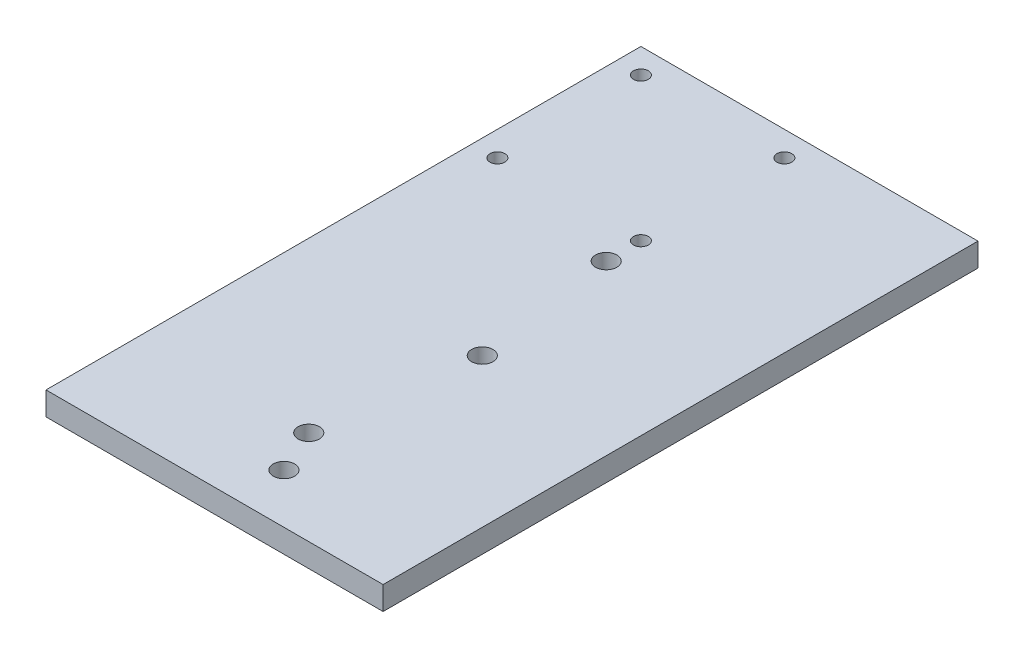
ISO-10303-21;
HEADER;
FILE_DESCRIPTION(('STEP AP214'),'2;1');
FILE_NAME('part.step','',(''),(''),'','','');
FILE_SCHEMA(('AUTOMOTIVE_DESIGN { 1 0 10303 214 1 1 1 1 }'));
ENDSEC;
DATA;
#1=APPLICATION_CONTEXT('core data for automotive mechanical design processes');
#2=APPLICATION_PROTOCOL_DEFINITION('international standard','automotive_design',2000,#1);
#3=PRODUCT_CONTEXT('',#1,'mechanical');
#4=PRODUCT('Part','Part','',(#3));
#5=PRODUCT_RELATED_PRODUCT_CATEGORY('part','',(#4));
#6=PRODUCT_DEFINITION_FORMATION('','',#4);
#7=PRODUCT_DEFINITION_CONTEXT('part definition',#1,'design');
#8=PRODUCT_DEFINITION('design','',#6,#7);
#9=PRODUCT_DEFINITION_SHAPE('','',#8);
#10=(LENGTH_UNIT() NAMED_UNIT(*) SI_UNIT(.MILLI.,.METRE.));
#11=(NAMED_UNIT(*) PLANE_ANGLE_UNIT() SI_UNIT($,.RADIAN.));
#12=(NAMED_UNIT(*) SI_UNIT($,.STERADIAN.) SOLID_ANGLE_UNIT());
#13=UNCERTAINTY_MEASURE_WITH_UNIT(LENGTH_MEASURE(1.E-05),#10,'distance_accuracy_value','');
#14=(GEOMETRIC_REPRESENTATION_CONTEXT(3) GLOBAL_UNCERTAINTY_ASSIGNED_CONTEXT((#13)) GLOBAL_UNIT_ASSIGNED_CONTEXT((#10,
#11,#12)) REPRESENTATION_CONTEXT('',''));
#15=CARTESIAN_POINT('',(0.,0.,0.));
#16=DIRECTION('',(0.,0.,1.));
#17=DIRECTION('',(1.,0.,0.));
#18=AXIS2_PLACEMENT_3D('',#15,#16,#17);
#19=CARTESIAN_POINT('',(0.,5.9944,0.));
#20=DIRECTION('',(0.,0.,-1.));
#21=DIRECTION('',(-1.,0.,0.));
#22=AXIS2_PLACEMENT_3D('',#19,#20,#21);
#23=PLANE('',#22);
#24=DIRECTION('',(1.,0.,0.));
#25=VECTOR('',#24,1.);
#26=CARTESIAN_POINT('',(0.,5.9944,0.));
#27=LINE('',#26,#25);
#28=CARTESIAN_POINT('',(2.54000000000002,5.9944,0.));
#29=VERTEX_POINT('',#28);
#30=CARTESIAN_POINT('',(88.9,5.9944,0.));
#31=VERTEX_POINT('',#30);
#32=EDGE_CURVE('E87',#29,#31,#27,.T.);
#33=ORIENTED_EDGE('',*,*,#32,.F.);
#34=DIRECTION('',(0.,1.,0.));
#35=VECTOR('',#34,1.);
#36=CARTESIAN_POINT('',(2.54000000000002,0.,0.));
#37=LINE('',#36,#35);
#38=CARTESIAN_POINT('',(2.54000000000002,0.,0.));
#39=VERTEX_POINT('',#38);
#40=EDGE_CURVE('E176',#39,#29,#37,.T.);
#41=ORIENTED_EDGE('',*,*,#40,.F.);
#42=DIRECTION('',(1.,0.,0.));
#43=VECTOR('',#42,1.);
#44=CARTESIAN_POINT('',(0.,0.,0.));
#45=LINE('',#44,#43);
#46=CARTESIAN_POINT('',(88.9,0.,0.));
#47=VERTEX_POINT('',#46);
#48=EDGE_CURVE('E97',#39,#47,#45,.T.);
#49=ORIENTED_EDGE('',*,*,#48,.T.);
#50=DIRECTION('',(0.,-1.,0.));
#51=VECTOR('',#50,1.);
#52=CARTESIAN_POINT('',(88.9,5.9944,0.));
#53=LINE('',#52,#51);
#54=EDGE_CURVE('E11',#31,#47,#53,.T.);
#55=ORIENTED_EDGE('',*,*,#54,.F.);
#56=EDGE_LOOP('',(#33,#41,#49,#55));
#57=FACE_BOUND('',#56,.T.);
#58=ADVANCED_FACE('F43',(#57),#23,.F.);
#59=CARTESIAN_POINT('',(88.9,5.9944,0.));
#60=DIRECTION('',(-1.,0.,0.));
#61=DIRECTION('',(0.,0.,1.));
#62=AXIS2_PLACEMENT_3D('',#59,#60,#61);
#63=PLANE('',#62);
#64=DIRECTION('',(0.,0.,-1.));
#65=VECTOR('',#64,1.);
#66=CARTESIAN_POINT('',(88.9,0.,0.));
#67=LINE('',#66,#65);
#68=CARTESIAN_POINT('',(88.9,0.,-152.4));
#69=VERTEX_POINT('',#68);
#70=EDGE_CURVE('E84',#47,#69,#67,.T.);
#71=ORIENTED_EDGE('',*,*,#70,.T.);
#72=DIRECTION('',(0.,-1.,0.));
#73=VECTOR('',#72,1.);
#74=CARTESIAN_POINT('',(88.9,5.9944,-152.4));
#75=LINE('',#74,#73);
#76=CARTESIAN_POINT('',(88.9,5.9944,-152.4));
#77=VERTEX_POINT('',#76);
#78=EDGE_CURVE('E51',#77,#69,#75,.T.);
#79=ORIENTED_EDGE('',*,*,#78,.F.);
#80=DIRECTION('',(0.,0.,-1.));
#81=VECTOR('',#80,1.);
#82=CARTESIAN_POINT('',(88.9,5.9944,0.));
#83=LINE('',#82,#81);
#84=EDGE_CURVE('E105',#31,#77,#83,.T.);
#85=ORIENTED_EDGE('',*,*,#84,.F.);
#86=ORIENTED_EDGE('',*,*,#54,.T.);
#87=EDGE_LOOP('',(#71,#79,#85,#86));
#88=FACE_BOUND('',#87,.T.);
#89=ADVANCED_FACE('F94',(#88),#63,.F.);
#90=CARTESIAN_POINT('',(0.,5.9944,-152.4));
#91=DIRECTION('',(0.,0.,-1.));
#92=DIRECTION('',(-1.,0.,0.));
#93=AXIS2_PLACEMENT_3D('',#90,#91,#92);
#94=PLANE('',#93);
#95=DIRECTION('',(0.,1.,0.));
#96=VECTOR('',#95,1.);
#97=CARTESIAN_POINT('',(2.54,0.,-152.4));
#98=LINE('',#97,#96);
#99=CARTESIAN_POINT('',(2.54000000000001,0.,-152.4));
#100=VERTEX_POINT('',#99);
#101=CARTESIAN_POINT('',(2.54,5.9944,-152.4));
#102=VERTEX_POINT('',#101);
#103=EDGE_CURVE('E58',#100,#102,#98,.T.);
#104=ORIENTED_EDGE('',*,*,#103,.T.);
#105=DIRECTION('',(1.,0.,0.));
#106=VECTOR('',#105,1.);
#107=CARTESIAN_POINT('',(0.,5.9944,-152.4));
#108=LINE('',#107,#106);
#109=EDGE_CURVE('E66',#102,#77,#108,.T.);
#110=ORIENTED_EDGE('',*,*,#109,.T.);
#111=ORIENTED_EDGE('',*,*,#78,.T.);
#112=DIRECTION('',(1.,0.,0.));
#113=VECTOR('',#112,1.);
#114=CARTESIAN_POINT('',(0.,0.,-152.4));
#115=LINE('',#114,#113);
#116=EDGE_CURVE('E80',#100,#69,#115,.T.);
#117=ORIENTED_EDGE('',*,*,#116,.F.);
#118=EDGE_LOOP('',(#104,#110,#111,#117));
#119=FACE_BOUND('',#118,.T.);
#120=ADVANCED_FACE('F90',(#119),#94,.T.);
#121=CARTESIAN_POINT('',(0.,5.9944,0.));
#122=DIRECTION('',(0.,1.,0.));
#123=DIRECTION('',(0.,0.,1.));
#124=AXIS2_PLACEMENT_3D('',#121,#122,#123);
#125=PLANE('',#124);
#126=DIRECTION('',(0.,0.,-1.));
#127=VECTOR('',#126,1.);
#128=CARTESIAN_POINT('',(2.54000000000002,5.9944,0.));
#129=LINE('',#128,#127);
#130=EDGE_CURVE('E167',#29,#102,#129,.T.);
#131=ORIENTED_EDGE('',*,*,#130,.F.);
#132=ORIENTED_EDGE('',*,*,#32,.T.);
#133=ORIENTED_EDGE('',*,*,#84,.T.);
#134=ORIENTED_EDGE('',*,*,#109,.F.);
#135=EDGE_LOOP('',(#131,#132,#133,#134));
#136=FACE_BOUND('',#135,.T.);
#137=CARTESIAN_POINT('',(45.6438,5.9944,-146.05));
#138=DIRECTION('',(0.,1.,0.));
#139=DIRECTION('',(0.,0.,1.));
#140=AXIS2_PLACEMENT_3D('',#137,#138,#139);
#141=CIRCLE('',#140,1.905);
#142=CARTESIAN_POINT('',(45.6438,5.9944,-144.145));
#143=VERTEX_POINT('',#142);
#144=EDGE_CURVE('E138',#143,#143,#141,.T.);
#145=ORIENTED_EDGE('',*,*,#144,.F.);
#146=EDGE_LOOP('',(#145));
#147=FACE_BOUND('',#146,.T.);
#148=CARTESIAN_POINT('',(8.89,5.9944,-146.05));
#149=DIRECTION('',(0.,1.,0.));
#150=DIRECTION('',(0.,0.,1.));
#151=AXIS2_PLACEMENT_3D('',#148,#149,#150);
#152=CIRCLE('',#151,1.90499999999999);
#153=CARTESIAN_POINT('',(8.89,5.9944,-144.145));
#154=VERTEX_POINT('',#153);
#155=EDGE_CURVE('E145',#154,#154,#152,.T.);
#156=ORIENTED_EDGE('',*,*,#155,.F.);
#157=EDGE_LOOP('',(#156));
#158=FACE_BOUND('',#157,.T.);
#159=CARTESIAN_POINT('',(8.89,5.9944,-109.2962));
#160=DIRECTION('',(0.,1.,0.));
#161=DIRECTION('',(0.,0.,1.));
#162=AXIS2_PLACEMENT_3D('',#159,#160,#161);
#163=CIRCLE('',#162,1.90500000000001);
#164=CARTESIAN_POINT('',(8.89,5.9944,-107.3912));
#165=VERTEX_POINT('',#164);
#166=EDGE_CURVE('E149',#165,#165,#163,.T.);
#167=ORIENTED_EDGE('',*,*,#166,.F.);
#168=EDGE_LOOP('',(#167));
#169=FACE_BOUND('',#168,.T.);
#170=CARTESIAN_POINT('',(45.6438,5.9944,-109.2962));
#171=DIRECTION('',(0.,1.,0.));
#172=DIRECTION('',(0.,0.,1.));
#173=AXIS2_PLACEMENT_3D('',#170,#171,#172);
#174=CIRCLE('',#173,1.905);
#175=CARTESIAN_POINT('',(45.6438,5.9944,-107.3912));
#176=VERTEX_POINT('',#175);
#177=EDGE_CURVE('E153',#176,#176,#174,.T.);
#178=ORIENTED_EDGE('',*,*,#177,.F.);
#179=EDGE_LOOP('',(#178));
#180=FACE_BOUND('',#179,.T.);
#181=CARTESIAN_POINT('',(50.8,5.9944,-63.5));
#182=DIRECTION('',(0.,1.,0.));
#183=DIRECTION('',(0.,0.,1.));
#184=AXIS2_PLACEMENT_3D('',#181,#182,#183);
#185=CIRCLE('',#184,2.7305);
#186=CARTESIAN_POINT('',(50.8,5.9944,-60.7695));
#187=VERTEX_POINT('',#186);
#188=EDGE_CURVE('E115',#187,#187,#185,.T.);
#189=ORIENTED_EDGE('',*,*,#188,.F.);
#190=EDGE_LOOP('',(#189));
#191=FACE_BOUND('',#190,.T.);
#192=CARTESIAN_POINT('',(50.8,5.9944,-12.7));
#193=DIRECTION('',(0.,1.,0.));
#194=DIRECTION('',(0.,0.,1.));
#195=AXIS2_PLACEMENT_3D('',#192,#193,#194);
#196=CIRCLE('',#195,2.7305);
#197=CARTESIAN_POINT('',(50.8,5.9944,-9.9695));
#198=VERTEX_POINT('',#197);
#199=EDGE_CURVE('E129',#198,#198,#196,.T.);
#200=ORIENTED_EDGE('',*,*,#199,.F.);
#201=EDGE_LOOP('',(#200));
#202=FACE_BOUND('',#201,.T.);
#203=CARTESIAN_POINT('',(45.72,5.9944,-100.33));
#204=DIRECTION('',(0.,1.,0.));
#205=DIRECTION('',(0.,0.,1.));
#206=AXIS2_PLACEMENT_3D('',#203,#204,#205);
#207=CIRCLE('',#206,2.7305);
#208=CARTESIAN_POINT('',(45.72,5.9944,-97.5995));
#209=VERTEX_POINT('',#208);
#210=EDGE_CURVE('E119',#209,#209,#207,.T.);
#211=ORIENTED_EDGE('',*,*,#210,.F.);
#212=EDGE_LOOP('',(#211));
#213=FACE_BOUND('',#212,.T.);
#214=CARTESIAN_POINT('',(45.72,5.9944,-24.13));
#215=DIRECTION('',(0.,1.,0.));
#216=DIRECTION('',(0.,0.,1.));
#217=AXIS2_PLACEMENT_3D('',#214,#215,#216);
#218=CIRCLE('',#217,2.7305);
#219=CARTESIAN_POINT('',(45.72,5.9944,-21.3995));
#220=VERTEX_POINT('',#219);
#221=EDGE_CURVE('E114',#220,#220,#218,.T.);
#222=ORIENTED_EDGE('',*,*,#221,.F.);
#223=EDGE_LOOP('',(#222));
#224=FACE_BOUND('',#223,.T.);
#225=ADVANCED_FACE('F186',(#136,#147,#158,#169,#180,#191,#202,#213,#224),#125,.T.);
#226=CARTESIAN_POINT('',(0.,0.,0.));
#227=DIRECTION('',(0.,1.,0.));
#228=DIRECTION('',(0.,0.,1.));
#229=AXIS2_PLACEMENT_3D('',#226,#227,#228);
#230=PLANE('',#229);
#231=CARTESIAN_POINT('',(45.6438,0.,-146.05));
#232=DIRECTION('',(0.,1.,0.));
#233=DIRECTION('',(0.,0.,1.));
#234=AXIS2_PLACEMENT_3D('',#231,#232,#233);
#235=CIRCLE('',#234,1.905);
#236=CARTESIAN_POINT('',(45.6438,0.,-144.145));
#237=VERTEX_POINT('',#236);
#238=EDGE_CURVE('E162',#237,#237,#235,.T.);
#239=ORIENTED_EDGE('',*,*,#238,.T.);
#240=EDGE_LOOP('',(#239));
#241=FACE_BOUND('',#240,.T.);
#242=CARTESIAN_POINT('',(8.89,0.,-146.05));
#243=DIRECTION('',(0.,1.,0.));
#244=DIRECTION('',(0.,0.,1.));
#245=AXIS2_PLACEMENT_3D('',#242,#243,#244);
#246=CIRCLE('',#245,1.90499999999999);
#247=CARTESIAN_POINT('',(8.89,0.,-144.145));
#248=VERTEX_POINT('',#247);
#249=EDGE_CURVE('E166',#248,#248,#246,.T.);
#250=ORIENTED_EDGE('',*,*,#249,.T.);
#251=EDGE_LOOP('',(#250));
#252=FACE_BOUND('',#251,.T.);
#253=CARTESIAN_POINT('',(8.89,0.,-109.2962));
#254=DIRECTION('',(0.,1.,0.));
#255=DIRECTION('',(0.,0.,1.));
#256=AXIS2_PLACEMENT_3D('',#253,#254,#255);
#257=CIRCLE('',#256,1.90500000000001);
#258=CARTESIAN_POINT('',(8.89,0.,-107.3912));
#259=VERTEX_POINT('',#258);
#260=EDGE_CURVE('E161',#259,#259,#257,.T.);
#261=ORIENTED_EDGE('',*,*,#260,.T.);
#262=EDGE_LOOP('',(#261));
#263=FACE_BOUND('',#262,.T.);
#264=CARTESIAN_POINT('',(45.6438,0.,-109.2962));
#265=DIRECTION('',(0.,1.,0.));
#266=DIRECTION('',(0.,0.,1.));
#267=AXIS2_PLACEMENT_3D('',#264,#265,#266);
#268=CIRCLE('',#267,1.905);
#269=CARTESIAN_POINT('',(45.6438,0.,-107.3912));
#270=VERTEX_POINT('',#269);
#271=EDGE_CURVE('E157',#270,#270,#268,.T.);
#272=ORIENTED_EDGE('',*,*,#271,.T.);
#273=EDGE_LOOP('',(#272));
#274=FACE_BOUND('',#273,.T.);
#275=CARTESIAN_POINT('',(50.8,0.,-63.5));
#276=DIRECTION('',(0.,1.,0.));
#277=DIRECTION('',(0.,0.,1.));
#278=AXIS2_PLACEMENT_3D('',#275,#276,#277);
#279=CIRCLE('',#278,2.7305);
#280=CARTESIAN_POINT('',(50.8,0.,-60.7695));
#281=VERTEX_POINT('',#280);
#282=EDGE_CURVE('E133',#281,#281,#279,.T.);
#283=ORIENTED_EDGE('',*,*,#282,.T.);
#284=EDGE_LOOP('',(#283));
#285=FACE_BOUND('',#284,.T.);
#286=CARTESIAN_POINT('',(50.8,0.,-12.7));
#287=DIRECTION('',(0.,1.,0.));
#288=DIRECTION('',(0.,0.,1.));
#289=AXIS2_PLACEMENT_3D('',#286,#287,#288);
#290=CIRCLE('',#289,2.7305);
#291=CARTESIAN_POINT('',(50.8,0.,-9.9695));
#292=VERTEX_POINT('',#291);
#293=EDGE_CURVE('E134',#292,#292,#290,.T.);
#294=ORIENTED_EDGE('',*,*,#293,.T.);
#295=EDGE_LOOP('',(#294));
#296=FACE_BOUND('',#295,.T.);
#297=CARTESIAN_POINT('',(45.72,0.,-100.33));
#298=DIRECTION('',(0.,1.,0.));
#299=DIRECTION('',(0.,0.,1.));
#300=AXIS2_PLACEMENT_3D('',#297,#298,#299);
#301=CIRCLE('',#300,2.7305);
#302=CARTESIAN_POINT('',(45.72,0.,-97.5995));
#303=VERTEX_POINT('',#302);
#304=EDGE_CURVE('E100',#303,#303,#301,.T.);
#305=ORIENTED_EDGE('',*,*,#304,.T.);
#306=EDGE_LOOP('',(#305));
#307=FACE_BOUND('',#306,.T.);
#308=CARTESIAN_POINT('',(45.72,0.,-24.13));
#309=DIRECTION('',(0.,1.,0.));
#310=DIRECTION('',(0.,0.,1.));
#311=AXIS2_PLACEMENT_3D('',#308,#309,#310);
#312=CIRCLE('',#311,2.7305);
#313=CARTESIAN_POINT('',(45.72,0.,-21.3995));
#314=VERTEX_POINT('',#313);
#315=EDGE_CURVE('E110',#314,#314,#312,.T.);
#316=ORIENTED_EDGE('',*,*,#315,.T.);
#317=EDGE_LOOP('',(#316));
#318=FACE_BOUND('',#317,.T.);
#319=ORIENTED_EDGE('',*,*,#48,.F.);
#320=DIRECTION('',(0.,0.,-1.));
#321=VECTOR('',#320,1.);
#322=CARTESIAN_POINT('',(2.54,0.,-152.4));
#323=LINE('',#322,#321);
#324=EDGE_CURVE('E85',#39,#100,#323,.T.);
#325=ORIENTED_EDGE('',*,*,#324,.T.);
#326=ORIENTED_EDGE('',*,*,#116,.T.);
#327=ORIENTED_EDGE('',*,*,#70,.F.);
#328=EDGE_LOOP('',(#319,#325,#326,#327));
#329=FACE_BOUND('',#328,.T.);
#330=ADVANCED_FACE('F82',(#241,#252,#263,#274,#285,#296,#307,#318,#329),#230,.F.);
#331=CARTESIAN_POINT('',(45.72,0.,-24.13));
#332=DIRECTION('',(0.,1.,0.));
#333=DIRECTION('',(0.,0.,1.));
#334=AXIS2_PLACEMENT_3D('',#331,#332,#333);
#335=CYLINDRICAL_SURFACE('',#334,2.7305);
#336=ORIENTED_EDGE('',*,*,#315,.F.);
#337=EDGE_LOOP('',(#336));
#338=FACE_BOUND('',#337,.T.);
#339=ORIENTED_EDGE('',*,*,#221,.T.);
#340=EDGE_LOOP('',(#339));
#341=FACE_BOUND('',#340,.T.);
#342=ADVANCED_FACE('F216',(#338,#341),#335,.F.);
#343=CARTESIAN_POINT('',(45.72,0.,-100.33));
#344=DIRECTION('',(0.,1.,0.));
#345=DIRECTION('',(0.,0.,1.));
#346=AXIS2_PLACEMENT_3D('',#343,#344,#345);
#347=CYLINDRICAL_SURFACE('',#346,2.7305);
#348=ORIENTED_EDGE('',*,*,#304,.F.);
#349=EDGE_LOOP('',(#348));
#350=FACE_BOUND('',#349,.T.);
#351=ORIENTED_EDGE('',*,*,#210,.T.);
#352=EDGE_LOOP('',(#351));
#353=FACE_BOUND('',#352,.T.);
#354=ADVANCED_FACE('F222',(#350,#353),#347,.F.);
#355=CARTESIAN_POINT('',(50.8,0.,-12.7));
#356=DIRECTION('',(0.,1.,0.));
#357=DIRECTION('',(0.,0.,1.));
#358=AXIS2_PLACEMENT_3D('',#355,#356,#357);
#359=CYLINDRICAL_SURFACE('',#358,2.7305);
#360=ORIENTED_EDGE('',*,*,#199,.T.);
#361=EDGE_LOOP('',(#360));
#362=FACE_BOUND('',#361,.T.);
#363=ORIENTED_EDGE('',*,*,#293,.F.);
#364=EDGE_LOOP('',(#363));
#365=FACE_BOUND('',#364,.T.);
#366=ADVANCED_FACE('F226',(#362,#365),#359,.F.);
#367=CARTESIAN_POINT('',(50.8,0.,-63.5));
#368=DIRECTION('',(0.,1.,0.));
#369=DIRECTION('',(0.,0.,1.));
#370=AXIS2_PLACEMENT_3D('',#367,#368,#369);
#371=CYLINDRICAL_SURFACE('',#370,2.7305);
#372=ORIENTED_EDGE('',*,*,#188,.T.);
#373=EDGE_LOOP('',(#372));
#374=FACE_BOUND('',#373,.T.);
#375=ORIENTED_EDGE('',*,*,#282,.F.);
#376=EDGE_LOOP('',(#375));
#377=FACE_BOUND('',#376,.T.);
#378=ADVANCED_FACE('F230',(#374,#377),#371,.F.);
#379=CARTESIAN_POINT('',(45.6438,0.,-109.2962));
#380=DIRECTION('',(0.,1.,0.));
#381=DIRECTION('',(0.,0.,1.));
#382=AXIS2_PLACEMENT_3D('',#379,#380,#381);
#383=CYLINDRICAL_SURFACE('',#382,1.905);
#384=ORIENTED_EDGE('',*,*,#177,.T.);
#385=EDGE_LOOP('',(#384));
#386=FACE_BOUND('',#385,.T.);
#387=ORIENTED_EDGE('',*,*,#271,.F.);
#388=EDGE_LOOP('',(#387));
#389=FACE_BOUND('',#388,.T.);
#390=ADVANCED_FACE('F234',(#386,#389),#383,.F.);
#391=CARTESIAN_POINT('',(8.89,0.,-109.2962));
#392=DIRECTION('',(0.,1.,0.));
#393=DIRECTION('',(0.,0.,1.));
#394=AXIS2_PLACEMENT_3D('',#391,#392,#393);
#395=CYLINDRICAL_SURFACE('',#394,1.90500000000001);
#396=ORIENTED_EDGE('',*,*,#166,.T.);
#397=EDGE_LOOP('',(#396));
#398=FACE_BOUND('',#397,.T.);
#399=ORIENTED_EDGE('',*,*,#260,.F.);
#400=EDGE_LOOP('',(#399));
#401=FACE_BOUND('',#400,.T.);
#402=ADVANCED_FACE('F237',(#398,#401),#395,.F.);
#403=CARTESIAN_POINT('',(8.89,0.,-146.05));
#404=DIRECTION('',(0.,1.,0.));
#405=DIRECTION('',(0.,0.,1.));
#406=AXIS2_PLACEMENT_3D('',#403,#404,#405);
#407=CYLINDRICAL_SURFACE('',#406,1.90499999999999);
#408=ORIENTED_EDGE('',*,*,#155,.T.);
#409=EDGE_LOOP('',(#408));
#410=FACE_BOUND('',#409,.T.);
#411=ORIENTED_EDGE('',*,*,#249,.F.);
#412=EDGE_LOOP('',(#411));
#413=FACE_BOUND('',#412,.T.);
#414=ADVANCED_FACE('F201',(#410,#413),#407,.F.);
#415=CARTESIAN_POINT('',(45.6438,0.,-146.05));
#416=DIRECTION('',(0.,1.,0.));
#417=DIRECTION('',(0.,0.,1.));
#418=AXIS2_PLACEMENT_3D('',#415,#416,#417);
#419=CYLINDRICAL_SURFACE('',#418,1.905);
#420=ORIENTED_EDGE('',*,*,#144,.T.);
#421=EDGE_LOOP('',(#420));
#422=FACE_BOUND('',#421,.T.);
#423=ORIENTED_EDGE('',*,*,#238,.F.);
#424=EDGE_LOOP('',(#423));
#425=FACE_BOUND('',#424,.T.);
#426=ADVANCED_FACE('F196',(#422,#425),#419,.F.);
#427=CARTESIAN_POINT('',(2.54,0.,-152.4));
#428=DIRECTION('',(1.,0.,0.));
#429=DIRECTION('',(0.,0.,-1.));
#430=AXIS2_PLACEMENT_3D('',#427,#428,#429);
#431=PLANE('',#430);
#432=ORIENTED_EDGE('',*,*,#130,.T.);
#433=ORIENTED_EDGE('',*,*,#103,.F.);
#434=ORIENTED_EDGE('',*,*,#324,.F.);
#435=ORIENTED_EDGE('',*,*,#40,.T.);
#436=EDGE_LOOP('',(#432,#433,#434,#435));
#437=FACE_BOUND('',#436,.T.);
#438=ADVANCED_FACE('F194',(#437),#431,.F.);
#439=CLOSED_SHELL('',(#58,#89,#120,#225,#330,#342,#354,#366,#378,#390,#402,#414,#426,#438));
#440=MANIFOLD_SOLID_BREP('B2',#439);
#441=ADVANCED_BREP_SHAPE_REPRESENTATION('',(#18,#440),#14);
#442=SHAPE_DEFINITION_REPRESENTATION(#9,#441);
ENDSEC;
END-ISO-10303-21;
